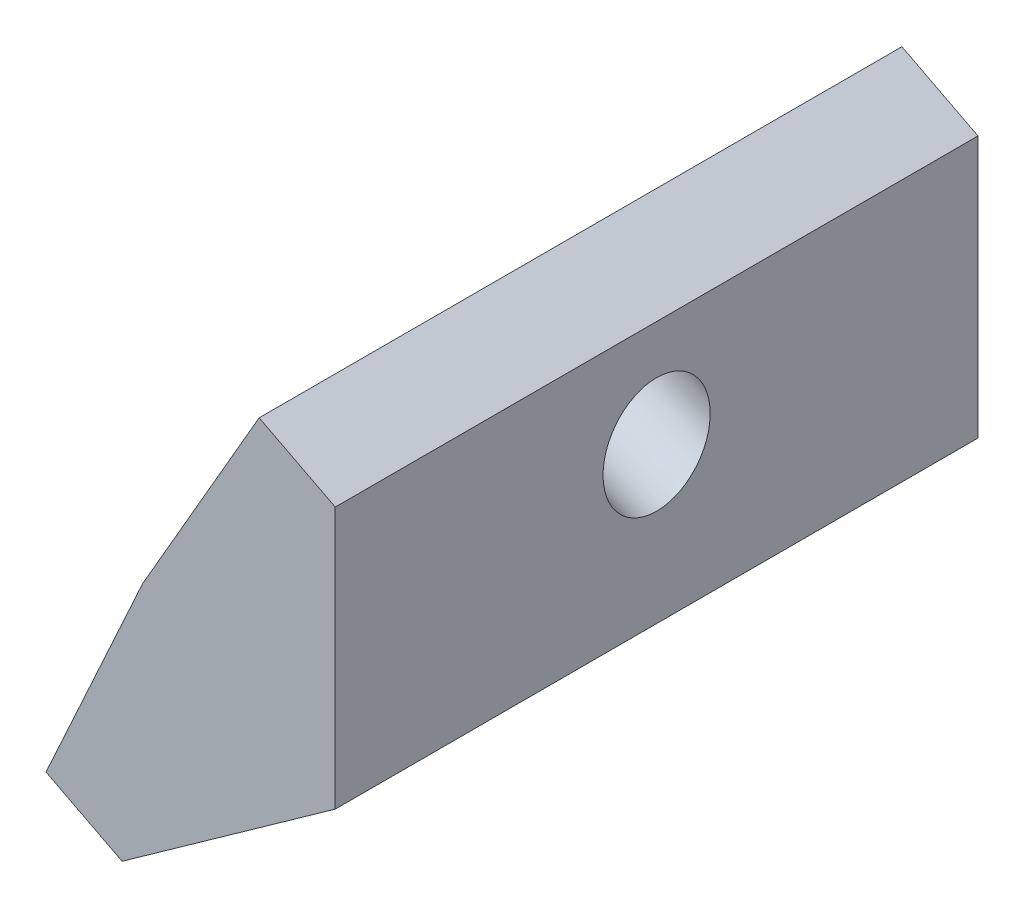
ISO-10303-21;
HEADER;
FILE_DESCRIPTION(('STEP AP214'),'2;1');
FILE_NAME('part.step','',(''),(''),'','','');
FILE_SCHEMA(('AUTOMOTIVE_DESIGN { 1 0 10303 214 1 1 1 1 }'));
ENDSEC;
DATA;
#1=APPLICATION_CONTEXT('core data for automotive mechanical design processes');
#2=APPLICATION_PROTOCOL_DEFINITION('international standard','automotive_design',2000,#1);
#3=PRODUCT_CONTEXT('',#1,'mechanical');
#4=PRODUCT('Part','Part','',(#3));
#5=PRODUCT_RELATED_PRODUCT_CATEGORY('part','',(#4));
#6=PRODUCT_DEFINITION_FORMATION('','',#4);
#7=PRODUCT_DEFINITION_CONTEXT('part definition',#1,'design');
#8=PRODUCT_DEFINITION('design','',#6,#7);
#9=PRODUCT_DEFINITION_SHAPE('','',#8);
#10=(LENGTH_UNIT() NAMED_UNIT(*) SI_UNIT(.MILLI.,.METRE.));
#11=(NAMED_UNIT(*) PLANE_ANGLE_UNIT() SI_UNIT($,.RADIAN.));
#12=(NAMED_UNIT(*) SI_UNIT($,.STERADIAN.) SOLID_ANGLE_UNIT());
#13=UNCERTAINTY_MEASURE_WITH_UNIT(LENGTH_MEASURE(1.E-05),#10,'distance_accuracy_value','');
#14=(GEOMETRIC_REPRESENTATION_CONTEXT(3) GLOBAL_UNCERTAINTY_ASSIGNED_CONTEXT((#13)) GLOBAL_UNIT_ASSIGNED_CONTEXT((#10,
#11,#12)) REPRESENTATION_CONTEXT('',''));
#15=CARTESIAN_POINT('',(0.,0.,0.));
#16=DIRECTION('',(0.,0.,1.));
#17=DIRECTION('',(1.,0.,0.));
#18=AXIS2_PLACEMENT_3D('',#15,#16,#17);
#19=CARTESIAN_POINT('',(-5.30593452675804,-3.07548921601845,7.5));
#20=DIRECTION('',(0.866025403784439,-0.499999999999999,0.));
#21=DIRECTION('',(0.5,0.866025403784439,0.));
#22=AXIS2_PLACEMENT_3D('',#19,#20,#21);
#23=PLANE('',#22);
#24=DIRECTION('',(-0.499999999999999,-0.866025403784439,0.));
#25=VECTOR('',#24,1.);
#26=CARTESIAN_POINT('',(-5.30593452675804,-3.07548921601845,-7.5));
#27=LINE('',#26,#25);
#28=CARTESIAN_POINT('',(-5.30593452675804,-3.07548921601845,-7.5));
#29=VERTEX_POINT('',#28);
#30=CARTESIAN_POINT('',(-8.02245661280733,-7.78064348893881,-7.5));
#31=VERTEX_POINT('',#30);
#32=EDGE_CURVE('E153',#29,#31,#27,.T.);
#33=ORIENTED_EDGE('',*,*,#32,.T.);
#34=DIRECTION('',(0.,0.,-1.));
#35=VECTOR('',#34,1.);
#36=CARTESIAN_POINT('',(-8.02245661280733,-7.78064348893881,7.5));
#37=LINE('',#36,#35);
#38=CARTESIAN_POINT('',(-8.02245661280733,-7.78064348893881,7.5));
#39=VERTEX_POINT('',#38);
#40=EDGE_CURVE('E123',#39,#31,#37,.T.);
#41=ORIENTED_EDGE('',*,*,#40,.F.);
#42=DIRECTION('',(-0.499999999999999,-0.866025403784439,0.));
#43=VECTOR('',#42,1.);
#44=CARTESIAN_POINT('',(-5.30593452675804,-3.07548921601845,7.5));
#45=LINE('',#44,#43);
#46=CARTESIAN_POINT('',(-5.30593452675804,-3.07548921601845,7.5));
#47=VERTEX_POINT('',#46);
#48=EDGE_CURVE('E86',#47,#39,#45,.T.);
#49=ORIENTED_EDGE('',*,*,#48,.F.);
#50=DIRECTION('',(0.,0.,-1.));
#51=VECTOR('',#50,1.);
#52=CARTESIAN_POINT('',(-5.30593452675804,-3.07548921601845,7.5));
#53=LINE('',#52,#51);
#54=EDGE_CURVE('E11',#47,#29,#53,.T.);
#55=ORIENTED_EDGE('',*,*,#54,.T.);
#56=EDGE_LOOP('',(#33,#41,#49,#55));
#57=FACE_BOUND('',#56,.T.);
#58=CARTESIAN_POINT('',(-7.15466967636295,-6.2775924248726,0.));
#59=CARTESIAN_POINT('',(-7.15466798521054,-6.27758949571069,0.0692362236254914));
#60=CARTESIAN_POINT('',(-7.15178289084238,-6.27259236568042,0.138545126920933));
#61=CARTESIAN_POINT('',(-7.14031807431845,-6.25273472096152,0.275213202125542));
#62=CARTESIAN_POINT('',(-7.1317383521396,-6.23787420623293,0.342572374026811));
#63=CARTESIAN_POINT('',(-7.10912290777668,-6.19870310756059,0.473532214921225));
#64=CARTESIAN_POINT('',(-7.09508719143439,-6.17439253373511,0.537132887938548));
#65=CARTESIAN_POINT('',(-7.0619463726398,-6.11699095177845,0.658808329160825));
#66=CARTESIAN_POINT('',(-7.04284127919197,-6.08389995924346,0.716883107180881));
#67=CARTESIAN_POINT('',(-7.0000888158206,-6.00985052053553,0.825908509980911));
#68=CARTESIAN_POINT('',(-6.97644145522332,-5.96889209051615,0.876859149387921));
#69=CARTESIAN_POINT('',(-6.92525666538034,-5.88023743393338,0.970230067617252));
#70=CARTESIAN_POINT('',(-6.89771924432411,-5.83254122155456,1.01265036439745));
#71=CARTESIAN_POINT('',(-6.83951387457678,-5.73172656387885,1.08779088424615));
#72=CARTESIAN_POINT('',(-6.80884593191688,-5.67860812902831,1.12051112600214));
#73=CARTESIAN_POINT('',(-6.74522537987903,-5.56841410049315,1.17534904865513));
#74=CARTESIAN_POINT('',(-6.71227277401225,-5.51133851289008,1.19746674584623));
#75=CARTESIAN_POINT('',(-6.64499176274149,-5.39480438298452,1.23048960581179));
#76=CARTESIAN_POINT('',(-6.61066335868405,-5.33534584301429,1.24139477955999));
#77=CARTESIAN_POINT('',(-6.54157755498611,-5.21568572092774,1.25169183715553));
#78=CARTESIAN_POINT('',(-6.50682015548005,-5.15548413904427,1.2510837246107));
#79=CARTESIAN_POINT('',(-6.4378350069323,-5.03599835679186,1.23837099278326));
#80=CARTESIAN_POINT('',(-6.4036072578896,-4.9767141564212,1.22626637352244));
#81=CARTESIAN_POINT('',(-6.33662545695099,-4.86069827401307,1.19089449813803));
#82=CARTESIAN_POINT('',(-6.30387140504538,-4.8039665919588,1.16762724208794));
#83=CARTESIAN_POINT('',(-6.24074039464589,-4.69462047441372,1.11057184917355));
#84=CARTESIAN_POINT('',(-6.21036343612693,-4.64200603887946,1.07678371242026));
#85=CARTESIAN_POINT('',(-6.15282444014098,-4.54234557441529,0.999618494192085));
#86=CARTESIAN_POINT('',(-6.12566240263102,-4.49529954541096,0.956241412845338));
#87=CARTESIAN_POINT('',(-6.07530239939776,-4.40807346114163,0.861094711792195));
#88=CARTESIAN_POINT('',(-6.05210443361614,-4.36789340577562,0.80932509220926));
#89=CARTESIAN_POINT('',(-6.01031238668225,-4.29550745713381,0.698821187597263));
#90=CARTESIAN_POINT('',(-5.99171830546347,-4.26330156374282,0.640086902668814));
#91=CARTESIAN_POINT('',(-5.95964685844257,-4.20775218803036,0.517273621051155));
#92=CARTESIAN_POINT('',(-5.94616949257598,-4.18440870559724,0.453194624429283));
#93=CARTESIAN_POINT('',(-5.92470318368016,-4.14722796793871,0.321459273157209));
#94=CARTESIAN_POINT('',(-5.91671424059949,-4.13339071262422,0.25380291854053));
#95=CARTESIAN_POINT('',(-5.9064451121526,-4.11560406040475,0.116778861933689));
#96=CARTESIAN_POINT('',(-5.90416492675717,-4.11165466344919,0.0474111599522843));
#97=CARTESIAN_POINT('',(-5.90537620095076,-4.11375265189438,-0.0911223855033391));
#98=CARTESIAN_POINT('',(-5.90886766053804,-4.11980003729212,-0.160288228977619));
#99=CARTESIAN_POINT('',(-5.92152593048045,-4.14172480396831,-0.296510418372036));
#100=CARTESIAN_POINT('',(-5.93069274086139,-4.15760218529144,-0.363566764282583));
#101=CARTESIAN_POINT('',(-5.95444889166487,-4.19874904547534,-0.493720495009659));
#102=CARTESIAN_POINT('',(-5.96903823213565,-4.22401852441965,-0.556817879790968));
#103=CARTESIAN_POINT('',(-6.00323706671206,-4.28325264346565,-0.677313405957969));
#104=CARTESIAN_POINT('',(-6.0228465608793,-4.31721728367402,-0.734711547273723));
#105=CARTESIAN_POINT('',(-6.0665448657214,-4.39290496786517,-0.84222548250053));
#106=CARTESIAN_POINT('',(-6.09063367646033,-4.4346280119589,-0.892341276307429));
#107=CARTESIAN_POINT('',(-6.14262623040584,-4.5246817570078,-0.983908255781001));
#108=CARTESIAN_POINT('',(-6.17052997366876,-4.57301245806052,-1.02535944131973));
#109=CARTESIAN_POINT('',(-6.22938278376548,-4.67494851531625,-1.09845391503492));
#110=CARTESIAN_POINT('',(-6.26033185064073,-4.72855387159104,-1.13009720307788));
#111=CARTESIAN_POINT('',(-6.32442169973164,-4.83956074646591,-1.18270310300237));
#112=CARTESIAN_POINT('',(-6.35756248197132,-4.89696226510762,-1.20366571476677));
#113=CARTESIAN_POINT('',(-6.42512169807883,-5.01397825992534,-1.2343320719433));
#114=CARTESIAN_POINT('',(-6.45954013195575,-5.07359273611712,-1.24403581727527));
#115=CARTESIAN_POINT('',(-6.52870534475454,-5.19339039880095,-1.2519167922377));
#116=CARTESIAN_POINT('',(-6.56345212367724,-5.25357358529443,-1.25009402183942));
#117=CARTESIAN_POINT('',(-6.63231566298722,-5.37284873416833,-1.23497224056463));
#118=CARTESIAN_POINT('',(-6.66643242337602,-5.43194069655138,-1.22167322971574));
#119=CARTESIAN_POINT('',(-6.733094939949,-5.54740356221617,-1.183965783398));
#120=CARTESIAN_POINT('',(-6.76564069614424,-5.60377446551709,-1.15955734800739));
#121=CARTESIAN_POINT('',(-6.82826355553612,-5.71224043969908,-1.10030427672833));
#122=CARTESIAN_POINT('',(-6.85834065875969,-5.76433551062679,-1.06545964095371));
#123=CARTESIAN_POINT('',(-6.91519664850416,-5.86281297357882,-0.986295271867666));
#124=CARTESIAN_POINT('',(-6.94197553506984,-5.9091953656807,-0.941975538684886));
#125=CARTESIAN_POINT('',(-6.99149653531914,-5.99496825415412,-0.84508327715462));
#126=CARTESIAN_POINT('',(-7.01423864906235,-6.03435875062887,-0.792510748928942));
#127=CARTESIAN_POINT('',(-7.0550587659998,-6.10506126713544,-0.680563297275454));
#128=CARTESIAN_POINT('',(-7.07313676926085,-6.13637328728298,-0.621188373945084));
#129=CARTESIAN_POINT('',(-7.10413043441191,-6.1900558900374,-0.497272324052833));
#130=CARTESIAN_POINT('',(-7.11704609636552,-6.21242647275442,-0.432731197554596));
#131=CARTESIAN_POINT('',(-7.13619088484642,-6.24558621910349,-0.307876369961909));
#132=CARTESIAN_POINT('',(-7.14301768018292,-6.2574105754792,-0.247928721161059));
#133=CARTESIAN_POINT('',(-7.149953216237,-6.26942327630258,-0.156436487901762));
#134=CARTESIAN_POINT('',(-7.15171468594311,-6.27247423132956,-0.125363392188712));
#135=CARTESIAN_POINT('',(-7.15407662536004,-6.27656523040408,-0.0628658555110105));
#136=CARTESIAN_POINT('',(-7.15467044432142,-6.27759375501569,-0.0314404213972012));
#137=CARTESIAN_POINT('',(-7.15466967636295,-6.2775924248726,0.));
#138=B_SPLINE_CURVE_WITH_KNOTS('',3,(#58,#59,#60,#61,#62,#63,#64,#65,#66,#67,#68,#69,#70,#71,
#72,#73,#74,#75,#76,#77,#78,#79,#80,#81,#82,#83,#84,#85,#86,#87,#88,#89,#90,#91,#92,#93,#94,#95,
#96,#97,#98,#99,#100,#101,#102,#103,#104,#105,#106,#107,#108,#109,#110,#111,#112,#113,#114,#115,
#116,#117,#118,#119,#120,#121,#122,#123,#124,#125,#126,#127,#128,#129,#130,#131,#132,#133,#134,
#135,#136,#137),.UNSPECIFIED.,.T.,.F.,(4,2,2,2,2,2,2,2,2,2,2,2,2,2,2,2,2,2,2,2,2,2,2,2,2,2,2,2,
2,2,2,2,2,2,2,2,2,2,2,4),(0.,0.207596123907973,0.415192248656901,0.622788151131218,
0.830383684866538,1.03797879236759,1.24557346283966,1.45316773337083,1.66076168486803,
1.86835543319228,2.07594911646454,2.28354279934329,2.49113648085512,2.6987301601764,
2.9063238367235,3.11391751021676,3.32151118071111,3.52910484859004,3.73669851452359,
3.94429217939492,4.15188584420358,4.35947950995598,4.56707317755514,4.77466684770174,
4.98226052081737,5.18985419699834,5.3974478760051,5.60504155728848,5.81263524004989,
6.02022892332876,6.22782260610787,6.4354162874247,6.64300996647699,6.85060364271061,
7.05819731588021,7.26579098607621,7.47338465371476,7.65713146999041,7.75086924008962,
7.84513939629271),.UNSPECIFIED.);
#139=CARTESIAN_POINT('',(-7.15466967636295,-6.2775924248726,0.));
#140=VERTEX_POINT('',#139);
#141=EDGE_CURVE('E162',#140,#140,#138,.T.);
#142=ORIENTED_EDGE('',*,*,#141,.F.);
#143=EDGE_LOOP('',(#142));
#144=FACE_BOUND('',#143,.T.);
#145=ADVANCED_FACE('F38',(#57,#144),#23,.F.);
#146=CARTESIAN_POINT('',(-3.5303,-10.0970811615136,7.5));
#147=DIRECTION('',(-1.,0.,0.));
#148=DIRECTION('',(0.,-1.,0.));
#149=AXIS2_PLACEMENT_3D('',#146,#147,#148);
#150=PLANE('',#149);
#151=DIRECTION('',(0.,1.,0.));
#152=VECTOR('',#151,1.);
#153=CARTESIAN_POINT('',(-3.5303,-10.0970811615136,-7.5));
#154=LINE('',#153,#152);
#155=CARTESIAN_POINT('',(-3.5303,-10.0970811615136,-7.5));
#156=VERTEX_POINT('',#155);
#157=CARTESIAN_POINT('',(-3.5303,-3.99106819498268,-7.5));
#158=VERTEX_POINT('',#157);
#159=EDGE_CURVE('E79',#156,#158,#154,.T.);
#160=ORIENTED_EDGE('',*,*,#159,.T.);
#161=DIRECTION('',(0.,0.,-1.));
#162=VECTOR('',#161,1.);
#163=CARTESIAN_POINT('',(-3.5303,-3.99106819498268,7.5));
#164=LINE('',#163,#162);
#165=CARTESIAN_POINT('',(-3.5303,-3.99106819498268,7.5));
#166=VERTEX_POINT('',#165);
#167=EDGE_CURVE('E53',#166,#158,#164,.T.);
#168=ORIENTED_EDGE('',*,*,#167,.F.);
#169=DIRECTION('',(0.,1.,0.));
#170=VECTOR('',#169,1.);
#171=CARTESIAN_POINT('',(-3.5303,-10.0970811615136,7.5));
#172=LINE('',#171,#170);
#173=CARTESIAN_POINT('',(-3.5303,-10.0970811615136,7.5));
#174=VERTEX_POINT('',#173);
#175=EDGE_CURVE('E62',#174,#166,#172,.T.);
#176=ORIENTED_EDGE('',*,*,#175,.F.);
#177=DIRECTION('',(0.,0.,-1.));
#178=VECTOR('',#177,1.);
#179=CARTESIAN_POINT('',(-3.5303,-10.0970811615136,7.5));
#180=LINE('',#179,#178);
#181=EDGE_CURVE('E76',#174,#156,#180,.T.);
#182=ORIENTED_EDGE('',*,*,#181,.T.);
#183=EDGE_LOOP('',(#160,#168,#176,#182));
#184=FACE_BOUND('',#183,.T.);
#185=CARTESIAN_POINT('',(-3.5303,-7.8245713723151,0.));
#186=CARTESIAN_POINT('',(-3.5303,-7.82457391247035,-0.0326195037891876));
#187=CARTESIAN_POINT('',(-3.53030000000001,-7.82319592864882,-0.0652242599714394));
#188=CARTESIAN_POINT('',(-3.53029999999998,-7.81498950017009,-0.162056922274657));
#189=CARTESIAN_POINT('',(-3.53029999999989,-7.80414604690198,-0.225997391363022));
#190=CARTESIAN_POINT('',(-3.5303000000001,-7.77187662782992,-0.352023967831403));
#191=CARTESIAN_POINT('',(-3.53030000000041,-7.75030853994581,-0.414072957647794));
#192=CARTESIAN_POINT('',(-3.53029999999959,-7.69732694150654,-0.533842655522574));
#193=CARTESIAN_POINT('',(-3.53029999999847,-7.66591296041661,-0.591563156559272));
#194=CARTESIAN_POINT('',(-3.53029999999913,-7.61199323708082,-0.67425367257423));
#195=CARTESIAN_POINT('',(-3.53029999999976,-7.59269944456054,-0.701375129832954));
#196=CARTESIAN_POINT('',(-3.53030000000024,-7.5520294322514,-0.753997309228562));
#197=CARTESIAN_POINT('',(-3.53030000000008,-7.53065382125852,-0.779498501604049));
#198=CARTESIAN_POINT('',(-3.53029999999983,-7.46313625607387,-0.853934708165165));
#199=CARTESIAN_POINT('',(-3.53029999999996,-7.41399868632011,-0.900200022014076));
#200=CARTESIAN_POINT('',(-3.53030000000004,-7.30925376205158,-0.984748717940325));
#201=CARTESIAN_POINT('',(-3.53029999999999,-7.25364182854817,-1.02302639668288));
#202=CARTESIAN_POINT('',(-3.53029999999998,-7.16388964946747,-1.07551943791076));
#203=CARTESIAN_POINT('',(-3.5303,-7.13148260544302,-1.09276250143054));
#204=CARTESIAN_POINT('',(-3.5303,-7.06544087744419,-1.12462071974914));
#205=CARTESIAN_POINT('',(-3.5303,-7.03180736542513,-1.13923830806639));
#206=CARTESIAN_POINT('',(-3.53029999999999,-6.92934375942115,-1.17909131531915));
#207=CARTESIAN_POINT('',(-3.53029999999999,-6.85891964257103,-1.20034494974378));
#208=CARTESIAN_POINT('',(-3.5303,-6.71570787908166,-1.23188598101619));
#209=CARTESIAN_POINT('',(-3.5303,-6.64292047793601,-1.24217451316674));
#210=CARTESIAN_POINT('',(-3.5303,-6.4966230994719,-1.25168740035256));
#211=CARTESIAN_POINT('',(-3.5303,-6.42311315025791,-1.25091218403848));
#212=CARTESIAN_POINT('',(-3.5303,-6.27704464661253,-1.23830229201089));
#213=CARTESIAN_POINT('',(-3.5303,-6.20448611717345,-1.22646732636306));
#214=CARTESIAN_POINT('',(-3.5303,-6.06200248843991,-1.19187674889382));
#215=CARTESIAN_POINT('',(-3.5303,-5.99207762963375,-1.16912014237963));
#216=CARTESIAN_POINT('',(-3.5303,-5.85660182030777,-1.11298072576296));
#217=CARTESIAN_POINT('',(-3.53030000000001,-5.79105154962075,-1.07959626866955));
#218=CARTESIAN_POINT('',(-3.53030000000003,-5.66613352871973,-1.00270845761217));
#219=CARTESIAN_POINT('',(-3.53030000000005,-5.60676711118886,-0.959202928959605));
#220=CARTESIAN_POINT('',(-3.53030000000007,-5.49756995916535,-0.864166618632253));
#221=CARTESIAN_POINT('',(-3.53030000000008,-5.44752790415538,-0.812879567568417));
#222=CARTESIAN_POINT('',(-3.53030000000007,-5.35842416308745,-0.704581337454006));
#223=CARTESIAN_POINT('',(-3.53030000000006,-5.31903261414969,-0.64784196062456));
#224=CARTESIAN_POINT('',(-3.53030000000006,-5.25139804578411,-0.530329191875033));
#225=CARTESIAN_POINT('',(-3.53030000000007,-5.22284955349265,-0.469733412710931));
#226=CARTESIAN_POINT('',(-3.53030000000003,-5.18823300293157,-0.376681968776199));
#227=CARTESIAN_POINT('',(-3.5303,-5.17813364590145,-0.345677565407062));
#228=CARTESIAN_POINT('',(-3.5303,-5.16053113536385,-0.282907376563175));
#229=CARTESIAN_POINT('',(-3.53030000000001,-5.15303050134665,-0.251140883953147));
#230=CARTESIAN_POINT('',(-3.53030000000003,-5.13455958657639,-0.155002645801818));
#231=CARTESIAN_POINT('',(-3.5303,-5.12762649369155,-0.0898087732382496));
#232=CARTESIAN_POINT('',(-3.5303,-5.12486330072194,0.0408010040458095));
#233=CARTESIAN_POINT('',(-3.53030000000001,-5.12903070994771,0.106216855670132));
#234=CARTESIAN_POINT('',(-3.5303,-5.14336972856942,0.202578607103788));
#235=CARTESIAN_POINT('',(-3.5303,-5.14942550739006,0.234184220831884));
#236=CARTESIAN_POINT('',(-3.5303,-5.16411304901567,0.296786671768801));
#237=CARTESIAN_POINT('',(-3.53030000000002,-5.17274445147549,0.327783593491137));
#238=CARTESIAN_POINT('',(-3.53029999999997,-5.20265032586628,0.420344270080214));
#239=CARTESIAN_POINT('',(-3.53029999999981,-5.2278184766318,0.480691827646078));
#240=CARTESIAN_POINT('',(-3.53030000000019,-5.28753573569402,0.59655847385015));
#241=CARTESIAN_POINT('',(-3.53030000000072,-5.32208897090053,0.652075424108309));
#242=CARTESIAN_POINT('',(-3.53030000000041,-5.380641969035,0.731580509745655));
#243=CARTESIAN_POINT('',(-3.53030000000011,-5.40165206951158,0.757820268613113));
#244=CARTESIAN_POINT('',(-3.53029999999989,-5.44567263119267,0.808548724835156));
#245=CARTESIAN_POINT('',(-3.53029999999996,-5.46868242836855,0.833037998578282));
#246=CARTESIAN_POINT('',(-3.53030000000008,-5.54100157626801,0.904234735132836));
#247=CARTESIAN_POINT('',(-3.53030000000002,-5.59316958150936,0.948089166732138));
#248=CARTESIAN_POINT('',(-3.53029999999998,-5.70355970450466,1.02740940934581));
#249=CARTESIAN_POINT('',(-3.53030000000001,-5.76178610110278,1.06286923283272));
#250=CARTESIAN_POINT('',(-3.53030000000001,-5.85531963166608,1.11079434891979));
#251=CARTESIAN_POINT('',(-3.5303,-5.88905503004722,1.12639778016577));
#252=CARTESIAN_POINT('',(-3.5303,-5.95762116709879,1.15487206036833));
#253=CARTESIAN_POINT('',(-3.5303,-5.99245086158251,1.16774542859163));
#254=CARTESIAN_POINT('',(-3.5303,-6.09829979633528,1.2022180310745));
#255=CARTESIAN_POINT('',(-3.53029999999999,-6.17071047833687,1.21968583257396));
#256=CARTESIAN_POINT('',(-3.53029999999999,-6.3173058882018,1.24331748594907));
#257=CARTESIAN_POINT('',(-3.5303,-6.391490469082,1.24948227111372));
#258=CARTESIAN_POINT('',(-3.5303,-6.53994152685629,1.250454945382));
#259=CARTESIAN_POINT('',(-3.5303,-6.61420800256364,1.24526299694992));
#260=CARTESIAN_POINT('',(-3.53029999999999,-6.76108084193489,1.22357810221477));
#261=CARTESIAN_POINT('',(-3.5303,-6.83368711572571,1.20708454560202));
#262=CARTESIAN_POINT('',(-3.5303,-6.97547342185756,1.16300134919204));
#263=CARTESIAN_POINT('',(-3.5303,-7.04465303498637,1.13541035549923));
#264=CARTESIAN_POINT('',(-3.53029999999998,-7.17774998269338,1.06952078753474));
#265=CARTESIAN_POINT('',(-3.53029999999996,-7.24166632475417,1.03122019966774));
#266=CARTESIAN_POINT('',(-3.53029999999994,-7.36124346572941,0.945337730839185));
#267=CARTESIAN_POINT('',(-3.53029999999993,-7.41703027019361,0.897931962544143));
#268=CARTESIAN_POINT('',(-3.53029999999992,-7.51790864074305,0.796312147729842));
#269=CARTESIAN_POINT('',(-3.53029999999992,-7.56332166520749,0.742418229440086));
#270=CARTESIAN_POINT('',(-3.53029999999993,-7.64305537899445,0.629686247433407));
#271=CARTESIAN_POINT('',(-3.53029999999994,-7.67770016729275,0.571078002521966));
#272=CARTESIAN_POINT('',(-3.53029999999996,-7.73583985249603,0.450533001650125));
#273=CARTESIAN_POINT('',(-3.53029999999996,-7.75961605172873,0.388732726990086));
#274=CARTESIAN_POINT('',(-3.53029999999998,-7.79342096031445,0.272596868053064));
#275=CARTESIAN_POINT('',(-3.5303,-7.80507834481693,0.218729068130521));
#276=CARTESIAN_POINT('',(-3.5303,-7.82064865387852,0.109893032888469));
#277=CARTESIAN_POINT('',(-3.5303,-7.82456709513247,0.0549256096892129));
#278=CARTESIAN_POINT('',(-3.5303,-7.8245713723151,0.));
#279=B_SPLINE_CURVE_WITH_KNOTS('',3,(#185,#186,#187,#188,#189,#190,#191,#192,#193,#194,#195,
#196,#197,#198,#199,#200,#201,#202,#203,#204,#205,#206,#207,#208,#209,#210,#211,#212,#213,#214,
#215,#216,#217,#218,#219,#220,#221,#222,#223,#224,#225,#226,#227,#228,#229,#230,#231,#232,#233,
#234,#235,#236,#237,#238,#239,#240,#241,#242,#243,#244,#245,#246,#247,#248,#249,#250,#251,#252,
#253,#254,#255,#256,#257,#258,#259,#260,#261,#262,#263,#264,#265,#266,#267,#268,#269,#270,#271,
#272,#273,#274,#275,#276,#277,#278),.UNSPECIFIED.,.T.,.F.,(4,2,2,2,2,2,2,2,2,2,2,2,2,2,2,2,2,2,
2,2,2,2,2,2,2,2,2,2,2,2,2,2,2,2,2,2,2,2,2,2,2,2,2,2,2,2,4),(0.,0.0978176838573576,
0.291389059184773,0.487596872273418,0.683814063554577,0.783576191088796,0.883309231815926,
1.08491198051467,1.28665818884161,1.39668083354719,1.50660096744318,1.72633503776649,
1.9460463550926,2.16574916001042,2.38545772465813,2.60518630314881,2.82494894942054,
3.04475885921046,3.25873296503977,3.46502069773662,3.66496738153368,3.76269381574919,
3.86051473340601,4.05620914893308,4.25185965897259,4.34830631979627,4.44473949347695,
4.63996125574701,4.83526900239106,4.9360201621942,5.03673799300387,5.24032198853683,
5.44405075755846,5.55545229713349,5.66675058514081,5.88924200915281,6.11171506124111,
6.3341849307511,6.55666681503035,6.77917585050209,7.00172674981673,7.22034195917831,
7.43079808199233,7.63411296728674,7.83181732269259,7.99664294346761,8.16135102606072),.UNSPECIFIED.);
#280=CARTESIAN_POINT('',(-3.5303,-7.8245713723151,0.));
#281=VERTEX_POINT('',#280);
#282=EDGE_CURVE('E42',#281,#281,#279,.T.);
#283=ORIENTED_EDGE('',*,*,#282,.F.);
#284=EDGE_LOOP('',(#283));
#285=FACE_BOUND('',#284,.T.);
#286=ADVANCED_FACE('F182',(#184,#285),#150,.F.);
#287=CARTESIAN_POINT('',(-10.2804154322381,-12.7222617406585,7.5));
#288=DIRECTION('',(0.909548697781145,-0.415597360873024,0.));
#289=DIRECTION('',(-0.415597360873024,-0.909548697781146,0.));
#290=AXIS2_PLACEMENT_3D('',#287,#288,#289);
#291=PLANE('',#290);
#292=DIRECTION('',(0.415597360873024,0.909548697781145,0.));
#293=VECTOR('',#292,1.);
#294=CARTESIAN_POINT('',(-10.2804154322381,-12.7222617406585,-7.5));
#295=LINE('',#294,#293);
#296=CARTESIAN_POINT('',(-10.2804154322381,-12.7222617406585,-7.5));
#297=VERTEX_POINT('',#296);
#298=EDGE_CURVE('E118',#297,#31,#295,.T.);
#299=ORIENTED_EDGE('',*,*,#298,.F.);
#300=DIRECTION('',(0.,0.,-1.));
#301=VECTOR('',#300,1.);
#302=CARTESIAN_POINT('',(-10.2804154322381,-12.7222617406585,7.5));
#303=LINE('',#302,#301);
#304=CARTESIAN_POINT('',(-10.2804154322381,-12.7222617406585,7.5));
#305=VERTEX_POINT('',#304);
#306=EDGE_CURVE('E114',#305,#297,#303,.T.);
#307=ORIENTED_EDGE('',*,*,#306,.F.);
#308=DIRECTION('',(0.415597360873024,0.909548697781145,0.));
#309=VECTOR('',#308,1.);
#310=CARTESIAN_POINT('',(-10.2804154322381,-12.7222617406585,7.5));
#311=LINE('',#310,#309);
#312=EDGE_CURVE('E103',#305,#39,#311,.T.);
#313=ORIENTED_EDGE('',*,*,#312,.T.);
#314=ORIENTED_EDGE('',*,*,#40,.T.);
#315=EDGE_LOOP('',(#299,#307,#313,#314));
#316=FACE_BOUND('',#315,.T.);
#317=CARTESIAN_POINT('',(-9.78286162521347,-11.6333486245968,0.));
#318=CARTESIAN_POINT('',(-9.78286021949484,-11.6333455481347,0.0692358626819145));
#319=CARTESIAN_POINT('',(-9.78046215248974,-11.6280972984415,0.138544405837957));
#320=CARTESIAN_POINT('',(-9.77093269372112,-11.6072417598131,0.275211754098851));
#321=CARTESIAN_POINT('',(-9.763801302646,-11.5916344723844,0.342570559487269));
#322=CARTESIAN_POINT('',(-9.74500353968827,-11.5504949406427,0.473529755417847));
#323=CARTESIAN_POINT('',(-9.73333716782914,-11.524962696381,0.537130145979474));
#324=CARTESIAN_POINT('',(-9.70579078032004,-11.4646765077613,0.658805162167846));
#325=CARTESIAN_POINT('',(-9.68991076470091,-11.4299225634706,0.716879787835021));
#326=CARTESIAN_POINT('',(-9.65437520364528,-11.3521518018489,0.825905040356857));
#327=CARTESIAN_POINT('',(-9.63471965824146,-11.3091349845893,0.876855667273156));
#328=CARTESIAN_POINT('',(-9.59217513388849,-11.2160248728175,0.970226708469674));
#329=CARTESIAN_POINT('',(-9.56928615496858,-11.1659315783692,1.012647122827));
#330=CARTESIAN_POINT('',(-9.52090607935893,-11.0600501678693,1.08778800206829));
#331=CARTESIAN_POINT('',(-9.49541498269115,-11.0042620518656,1.12050846703408));
#332=CARTESIAN_POINT('',(-9.44253374289061,-10.8885296932756,1.17534692644399));
#333=CARTESIAN_POINT('',(-9.41514359977097,-10.8285854507179,1.19746492096138));
#334=CARTESIAN_POINT('',(-9.35921971617508,-10.7061941646119,1.23048843042266));
#335=CARTESIAN_POINT('',(-9.33068597570412,-10.6437471210751,1.24139394541843));
#336=CARTESIAN_POINT('',(-9.27326188537722,-10.5180725824583,1.25169171124795));
#337=CARTESIAN_POINT('',(-9.24437153552192,-10.4548450873796,1.25108396210281));
#338=CARTESIAN_POINT('',(-9.18703104959423,-10.3293535197813,1.23837196303159));
#339=CARTESIAN_POINT('',(-9.15858091352234,-10.2670894472628,1.22626771309218));
#340=CARTESIAN_POINT('',(-9.10290553752402,-10.1452420283298,1.19089655368164));
#341=CARTESIAN_POINT('',(-9.07568029760252,-10.085658681926,1.16762964416559));
#342=CARTESIAN_POINT('',(-9.02320561444145,-9.9708160861132,1.11057488097868));
#343=CARTESIAN_POINT('',(-8.99795617121462,-9.91555683673198,1.07678702723998));
#344=CARTESIAN_POINT('',(-8.95012949024339,-9.81088654887165,0.999622268521565));
#345=CARTESIAN_POINT('',(-8.92755225252081,-9.76147551044028,0.95624536346354));
#346=CARTESIAN_POINT('',(-8.88569269193948,-9.66986446474821,0.861098873798075));
#347=CARTESIAN_POINT('',(-8.86641036911034,-9.62766445755232,0.809329289115193));
#348=CARTESIAN_POINT('',(-8.83167247254296,-9.55163941129084,0.698825296714466));
#349=CARTESIAN_POINT('',(-8.81621689883848,-9.51781437229917,0.640090888935141));
#350=CARTESIAN_POINT('',(-8.78955878970552,-9.45947221055816,0.517277211959707));
#351=CARTESIAN_POINT('',(-8.77835625430978,-9.43495508788048,0.453197942722452));
#352=CARTESIAN_POINT('',(-8.76051320737925,-9.39590498403471,0.321461933665323));
#353=CARTESIAN_POINT('',(-8.75387269558672,-9.38137200230257,0.253805194047554));
#354=CARTESIAN_POINT('',(-8.74533685356897,-9.36269102710245,0.116780330417339));
#355=CARTESIAN_POINT('',(-8.74344152154652,-9.35854302970117,0.0474122070530877));
#356=CARTESIAN_POINT('',(-8.74444831050702,-9.36074642094995,-0.0911221816600563));
#357=CARTESIAN_POINT('',(-8.74735043149086,-9.36709780960196,-0.160288447008912));
#358=CARTESIAN_POINT('',(-8.75787208075343,-9.39012479024778,-0.296511420127743));
#359=CARTESIAN_POINT('',(-8.76549160901905,-9.40680038221291,-0.363568127903578));
#360=CARTESIAN_POINT('',(-8.78523791292043,-9.45001582747407,-0.493722474367872));
#361=CARTESIAN_POINT('',(-8.79736468853169,-9.47655568071649,-0.556820113077853));
#362=CARTESIAN_POINT('',(-8.82579101057157,-9.53876763543093,-0.677316012191553));
#363=CARTESIAN_POINT('',(-8.84209055696889,-9.57443973683447,-0.734714272638009));
#364=CARTESIAN_POINT('',(-8.87841285416,-9.65393229675159,-0.842228309051983));
#365=CARTESIAN_POINT('',(-8.89843560492125,-9.69775275519394,-0.892344085083144));
#366=CARTESIAN_POINT('',(-8.94165205564256,-9.79233340025319,-0.983910912570452));
#367=CARTESIAN_POINT('',(-8.96484575557401,-9.84309358680746,-1.02536196410478));
#368=CARTESIAN_POINT('',(-9.01376439367196,-9.95015365929145,-1.0984560898284));
#369=CARTESIAN_POINT('',(-9.0394893318174,-10.0064535451751,-1.13009916409927));
#370=CARTESIAN_POINT('',(-9.09276092410719,-10.1230402032186,-1.18270459852465));
#371=CARTESIAN_POINT('',(-9.12030757823932,-10.1833269753518,-1.20366695875074));
#372=CARTESIAN_POINT('',(-9.17646283820523,-10.3062246363674,-1.2343328115842));
#373=CARTESIAN_POINT('',(-9.20507144403439,-10.3688355252397,-1.24403630424056));
#374=CARTESIAN_POINT('',(-9.26256155520317,-10.4946545526729,-1.2519167950458));
#375=CARTESIAN_POINT('',(-9.29144306054236,-10.5578626912329,-1.25009379321224));
#376=CARTESIAN_POINT('',(-9.3486823923524,-10.683132879668,-1.23497157381143));
#377=CARTESIAN_POINT('',(-9.37704021882248,-10.7451949295414,-1.22167235622729));
#378=CARTESIAN_POINT('',(-9.43245005662419,-10.8664612092669,-1.18396450648421));
#379=CARTESIAN_POINT('',(-9.45950206795022,-10.9256654391067,-1.15955587427746));
#380=CARTESIAN_POINT('',(-9.51155415471512,-11.0395831685994,-1.10030239222836));
#381=CARTESIAN_POINT('',(-9.53655423014033,-11.0942966682224,-1.06545754231645));
#382=CARTESIAN_POINT('',(-9.58381290857688,-11.1977238635745,-0.986292697665745));
#383=CARTESIAN_POINT('',(-9.60607151156549,-11.2464375592538,-0.941972702848335));
#384=CARTESIAN_POINT('',(-9.64723334615726,-11.3365216083262,-0.845079848038765));
#385=CARTESIAN_POINT('',(-9.66613657773016,-11.377891961653,-0.792506987972176));
#386=CARTESIAN_POINT('',(-9.70006620977775,-11.4521480940313,-0.680558797629221));
#387=CARTESIAN_POINT('',(-9.71509261021852,-11.4850338730087,-0.621183467293314));
#388=CARTESIAN_POINT('',(-9.74085443255294,-11.5414144811711,-0.497266542456662));
#389=CARTESIAN_POINT('',(-9.75158985441429,-11.5649093102856,-0.432724947917026));
#390=CARTESIAN_POINT('',(-9.76750262342835,-11.5997349364744,-0.307870659100862));
#391=CARTESIAN_POINT('',(-9.77317684676843,-11.6121531636716,-0.247924083108692));
#392=CARTESIAN_POINT('',(-9.77894145043296,-11.624769191226,-0.156433524947281));
#393=CARTESIAN_POINT('',(-9.78040552931435,-11.627973376732,-0.125361012415933));
#394=CARTESIAN_POINT('',(-9.78236869975118,-11.6322698407677,-0.0628646576544186));
#395=CARTESIAN_POINT('',(-9.78286226354659,-11.6333500216102,-0.0314398223443869));
#396=CARTESIAN_POINT('',(-9.78286162521347,-11.6333486245968,0.));
#397=B_SPLINE_CURVE_WITH_KNOTS('',3,(#317,#318,#319,#320,#321,#322,#323,#324,#325,#326,#327,
#328,#329,#330,#331,#332,#333,#334,#335,#336,#337,#338,#339,#340,#341,#342,#343,#344,#345,#346,
#347,#348,#349,#350,#351,#352,#353,#354,#355,#356,#357,#358,#359,#360,#361,#362,#363,#364,#365,
#366,#367,#368,#369,#370,#371,#372,#373,#374,#375,#376,#377,#378,#379,#380,#381,#382,#383,#384,
#385,#386,#387,#388,#389,#390,#391,#392,#393,#394,#395,#396),.UNSPECIFIED.,.T.,.F.,(4,2,2,2,2,2,
2,2,2,2,2,2,2,2,2,2,2,2,2,2,2,2,2,2,2,2,2,2,2,2,2,2,2,2,2,2,2,2,2,4),(0.,0.207595043011116,
0.415190055829752,0.622785067573067,0.830380077797414,1.03797508622557,1.24557009277712,
1.45316509757725,1.66076010094304,1.86835510334871,2.07595010537368,2.28354510763908,
2.49114011073969,2.69873511517879,2.90633012131302,3.11392512931328,3.32152013914604,
3.52911515057699,3.73671015028008,3.94430507135664,4.1518999924715,4.35949491300967,
4.56708983241936,4.77468475027241,4.98227966631121,5.18987458047696,5.39746949291604,
5.60506440396404,5.81265931410893,6.02025422393764,6.22784913407174,6.43544404509935,
6.64303895751067,6.85063387164432,7.05822878765023,7.26582370547316,7.47341862485882,
7.65716205990831,7.75089805762192,7.84516641825211),.UNSPECIFIED.);
#398=CARTESIAN_POINT('',(-9.78286162521347,-11.6333486245968,0.));
#399=VERTEX_POINT('',#398);
#400=EDGE_CURVE('E132',#399,#399,#397,.T.);
#401=ORIENTED_EDGE('',*,*,#400,.F.);
#402=EDGE_LOOP('',(#401));
#403=FACE_BOUND('',#402,.T.);
#404=ADVANCED_FACE('F115',(#316,#403),#291,.F.);
#405=CARTESIAN_POINT('',(-3.5303,-10.0970811615136,7.5));
#406=DIRECTION('',(-0.579893597821015,0.81469222115238,0.));
#407=DIRECTION('',(0.81469222115238,0.579893597821015,0.));
#408=AXIS2_PLACEMENT_3D('',#405,#406,#407);
#409=PLANE('',#408);
#410=DIRECTION('',(-0.81469222115238,-0.579893597821015,0.));
#411=VECTOR('',#410,1.);
#412=CARTESIAN_POINT('',(-3.5303,-10.0970811615136,-7.5));
#413=LINE('',#412,#411);
#414=CARTESIAN_POINT('',(-8.50482126608833,-13.637918989017,-7.5));
#415=VERTEX_POINT('',#414);
#416=EDGE_CURVE('E128',#156,#415,#413,.T.);
#417=ORIENTED_EDGE('',*,*,#416,.F.);
#418=ORIENTED_EDGE('',*,*,#181,.F.);
#419=DIRECTION('',(-0.81469222115238,-0.579893597821015,0.));
#420=VECTOR('',#419,1.);
#421=CARTESIAN_POINT('',(-3.5303,-10.0970811615136,7.5));
#422=LINE('',#421,#420);
#423=CARTESIAN_POINT('',(-8.50482126608833,-13.637918989017,7.5));
#424=VERTEX_POINT('',#423);
#425=EDGE_CURVE('E111',#174,#424,#422,.T.);
#426=ORIENTED_EDGE('',*,*,#425,.T.);
#427=DIRECTION('',(0.,0.,-1.));
#428=VECTOR('',#427,1.);
#429=CARTESIAN_POINT('',(-8.50482126608833,-13.637918989017,7.5));
#430=LINE('',#429,#428);
#431=EDGE_CURVE('E127',#424,#415,#430,.T.);
#432=ORIENTED_EDGE('',*,*,#431,.T.);
#433=EDGE_LOOP('',(#417,#418,#426,#432));
#434=FACE_BOUND('',#433,.T.);
#435=CARTESIAN_POINT('',(-7.58055404623483,-12.9800304888534,0.));
#436=CARTESIAN_POINT('',(-7.58055619446338,-12.9800320179511,-0.032620172346701));
#437=CARTESIAN_POINT('',(-7.57943350201113,-12.979232891424,-0.0652251255952535));
#438=CARTESIAN_POINT('',(-7.57274764280771,-12.9744739323381,-0.162058820600234));
#439=CARTESIAN_POINT('',(-7.56391349844551,-12.9681858352814,-0.226000376510881));
#440=CARTESIAN_POINT('',(-7.53762375121125,-12.9494729327724,-0.352027880413007));
#441=CARTESIAN_POINT('',(-7.52005250161495,-12.9369658105958,-0.414076753130782));
#442=CARTESIAN_POINT('',(-7.47688839883746,-12.9062418313957,-0.533848330684639));
#443=CARTESIAN_POINT('',(-7.45129489807741,-12.888024513429,-0.591570685805678));
#444=CARTESIAN_POINT('',(-7.40736573214612,-12.8567559663396,-0.674263157672953));
#445=CARTESIAN_POINT('',(-7.39164700693161,-12.8455674611833,-0.701384888022065));
#446=CARTESIAN_POINT('',(-7.35851306423365,-12.8219828966793,-0.754007446458208));
#447=CARTESIAN_POINT('',(-7.34109835096923,-12.8095871962321,-0.779508752595852));
#448=CARTESIAN_POINT('',(-7.2860916767446,-12.7704337375487,-0.853945378437238));
#449=CARTESIAN_POINT('',(-7.24605915996378,-12.7419388046366,-0.900210927446113));
#450=CARTESIAN_POINT('',(-7.16072309636488,-12.6811970476156,-0.984759861155538));
#451=CARTESIAN_POINT('',(-7.11541581547448,-12.6489475656138,-1.02303753695062));
#452=CARTESIAN_POINT('',(-7.04229481832196,-12.5969004280395,-1.07552993396083));
#453=CARTESIAN_POINT('',(-7.01589317995116,-12.5781078820133,-1.09277253229497));
#454=CARTESIAN_POINT('',(-6.96208977434013,-12.5398109035413,-1.12462980768852));
#455=CARTESIAN_POINT('',(-6.93468896187141,-12.5203071506967,-1.13924691829635));
#456=CARTESIAN_POINT('',(-6.85121313033932,-12.4608894969848,-1.17909846234491));
#457=CARTESIAN_POINT('',(-6.79383950128233,-12.4200512524182,-1.20035107997038));
#458=CARTESIAN_POINT('',(-6.67716678925065,-12.3370042354087,-1.23188995050248));
#459=CARTESIAN_POINT('',(-6.61786790622416,-12.2947956052878,-1.2421773384781));
#460=CARTESIAN_POINT('',(-6.4986815984277,-12.2099594241575,-1.25168779227564));
#461=CARTESIAN_POINT('',(-6.43879419654135,-12.1673318894366,-1.25091128661166));
#462=CARTESIAN_POINT('',(-6.31979467115402,-12.0826286590335,-1.23829868740145));
#463=CARTESIAN_POINT('',(-6.26068256802191,-12.0405529778498,-1.22646230387454));
#464=CARTESIAN_POINT('',(-6.14460402711693,-11.9579288886938,-1.19186881586603));
#465=CARTESIAN_POINT('',(-6.08763778527683,-11.9173806201854,-1.16911071674634));
#466=CARTESIAN_POINT('',(-5.97726895106773,-11.8388206699428,-1.1129683308006));
#467=CARTESIAN_POINT('',(-5.92386691253264,-11.8008093824245,-1.07958239716685));
#468=CARTESIAN_POINT('',(-5.82209994692271,-11.7283721965835,-1.00269177008623));
#469=CARTESIAN_POINT('',(-5.7737361054725,-11.6939470710026,-0.959184902295506));
#470=CARTESIAN_POINT('',(-5.68477735354303,-11.6306267036606,-0.864146341955463));
#471=CARTESIAN_POINT('',(-5.64401026016697,-11.6016089030277,-0.812858395625815));
#472=CARTESIAN_POINT('',(-5.57142140110195,-11.549940538519,-0.704558369136124));
#473=CARTESIAN_POINT('',(-5.53933095507447,-11.5270987294046,-0.647818017289657));
#474=CARTESIAN_POINT('',(-5.48423251611252,-11.4878799530687,-0.530303246864699));
#475=CARTESIAN_POINT('',(-5.46097571174955,-11.4713258831933,-0.469706389324136));
#476=CARTESIAN_POINT('',(-5.43277602064688,-11.4512534927783,-0.376653390619736));
#477=CARTESIAN_POINT('',(-5.42454884239345,-11.4453974309756,-0.345648382416082));
#478=CARTESIAN_POINT('',(-5.41020963203154,-11.4351908571667,-0.282877055684648));
#479=CARTESIAN_POINT('',(-5.40409965256256,-11.4308418062185,-0.25111003009386));
#480=CARTESIAN_POINT('',(-5.38905372741334,-11.4201321965761,-0.154970025608952));
#481=CARTESIAN_POINT('',(-5.38340692952729,-11.4161128358196,-0.0897750270545907));
#482=CARTESIAN_POINT('',(-5.38115897107998,-11.4145127509311,0.0408366681585154));
#483=CARTESIAN_POINT('',(-5.38455578162907,-11.4169305826463,0.106253311803799));
#484=CARTESIAN_POINT('',(-5.39624018458751,-11.4252474786397,0.202616026761628));
#485=CARTESIAN_POINT('',(-5.40117462354433,-11.4287597860923,0.23422194159285));
#486=CARTESIAN_POINT('',(-5.41314214995202,-11.4372782078538,0.296824909958501));
#487=CARTESIAN_POINT('',(-5.42017494385541,-11.4422841132172,0.327822048011171));
#488=CARTESIAN_POINT('',(-5.44454163868293,-11.4596281972327,0.420383255441069));
#489=CARTESIAN_POINT('',(-5.46504770732243,-11.4742243080236,0.480730994216418));
#490=CARTESIAN_POINT('',(-5.51370245922746,-11.5088565021223,0.596597634165105));
#491=CARTESIAN_POINT('',(-5.54185450422256,-11.5288949782915,0.652114397078273));
#492=CARTESIAN_POINT('',(-5.58955984550702,-11.5628513869501,0.731618818063303));
#493=CARTESIAN_POINT('',(-5.60667748105122,-11.5750356290526,0.757858248603941));
#494=CARTESIAN_POINT('',(-5.64254241996648,-11.6005641021655,0.80858595165373));
#495=CARTESIAN_POINT('',(-5.66128918245067,-11.6139079481754,0.833074800489644));
#496=CARTESIAN_POINT('',(-5.72020962760912,-11.6558472082311,0.904270120100062));
#497=CARTESIAN_POINT('',(-5.76271221863257,-11.6861003268756,0.948123397779057));
#498=CARTESIAN_POINT('',(-5.85264956112245,-11.7501172497831,1.0274408550705));
#499=CARTESIAN_POINT('',(-5.9000877980878,-11.7838835350059,1.06289904748588));
#500=CARTESIAN_POINT('',(-5.97629077252895,-11.838124407652,1.11082092225525));
#501=CARTESIAN_POINT('',(-6.00377505610236,-11.8576875747857,1.12642297510907));
#502=CARTESIAN_POINT('',(-6.05963590750321,-11.8974490322479,1.15489444246823));
#503=CARTESIAN_POINT('',(-6.08801162470438,-11.9176467171052,1.16776637632277));
#504=CARTESIAN_POINT('',(-6.17424651643689,-11.97902825522,1.20223458593728));
#505=CARTESIAN_POINT('',(-6.23323916634511,-12.0210189102331,1.21969933692758));
#506=CARTESIAN_POINT('',(-6.35266940435937,-12.1060287195974,1.24332464035401));
#507=CARTESIAN_POINT('',(-6.41310687279459,-12.1490477887675,1.24948612574852));
#508=CARTESIAN_POINT('',(-6.53404810862469,-12.2351331183552,1.2504519689443));
#509=CARTESIAN_POINT('',(-6.5945518750603,-12.27819937809,1.24525648895915));
#510=CARTESIAN_POINT('',(-6.71420643681599,-12.3633688599025,1.22356435695787));
#511=CARTESIAN_POINT('',(-6.77335715887178,-12.405472029831,1.20706709446575));
#512=CARTESIAN_POINT('',(-6.88886671227423,-12.4876911167035,1.16297641930432));
#513=CARTESIAN_POINT('',(-6.94522520201232,-12.5278067904922,1.13538165268583));
#514=CARTESIAN_POINT('',(-7.05365443858677,-12.6049861454358,1.06948461795692));
#515=CARTESIAN_POINT('',(-7.10572437675081,-12.642049250982,1.03118033635993));
#516=CARTESIAN_POINT('',(-7.20313705325375,-12.7113870769536,0.945291653339315));
#517=CARTESIAN_POINT('',(-7.24858256340126,-12.7437349498067,0.897883539486949));
#518=CARTESIAN_POINT('',(-7.33076051008865,-12.8022287759766,0.796259386920704));
#519=CARTESIAN_POINT('',(-7.36775478640018,-12.8285611054528,0.742363378321768));
#520=CARTESIAN_POINT('',(-7.43270668555335,-12.8747935224409,0.62962782947952));
#521=CARTESIAN_POINT('',(-7.46092829119942,-12.8948815115115,0.571018016244758));
#522=CARTESIAN_POINT('',(-7.50828794611466,-12.9285918624481,0.450469074132241));
#523=CARTESIAN_POINT('',(-7.52765510533591,-12.9423773035616,0.388666395408678));
#524=CARTESIAN_POINT('',(-7.55505704744654,-12.9618818604793,0.273089652672434));
#525=CARTESIAN_POINT('',(-7.56448249366778,-12.96859084306,0.219805132463695));
#526=CARTESIAN_POINT('',(-7.57729232062953,-12.9777088098841,0.111014489783288));
#527=CARTESIAN_POINT('',(-7.58055039220901,-12.9800278879373,0.0554852287514976));
#528=CARTESIAN_POINT('',(-7.58055404623483,-12.9800304888534,0.));
#529=B_SPLINE_CURVE_WITH_KNOTS('',3,(#435,#436,#437,#438,#439,#440,#441,#442,#443,#444,#445,
#446,#447,#448,#449,#450,#451,#452,#453,#454,#455,#456,#457,#458,#459,#460,#461,#462,#463,#464,
#465,#466,#467,#468,#469,#470,#471,#472,#473,#474,#475,#476,#477,#478,#479,#480,#481,#482,#483,
#484,#485,#486,#487,#488,#489,#490,#491,#492,#493,#494,#495,#496,#497,#498,#499,#500,#501,#502,
#503,#504,#505,#506,#507,#508,#509,#510,#511,#512,#513,#514,#515,#516,#517,#518,#519,#520,#521,
#522,#523,#524,#525,#526,#527,#528),.UNSPECIFIED.,.T.,.F.,(4,2,2,2,2,2,2,2,2,2,2,2,2,2,2,2,2,2,
2,2,2,2,2,2,2,2,2,2,2,2,2,2,2,2,2,2,2,2,2,2,2,2,2,2,2,2,4),(0.,0.0978188337550479,
0.291393046650954,0.487600535216292,0.683823866287168,0.78358713636112,0.883320836731926,
1.08492543222543,1.28667362405951,1.39669519581269,1.50661425699778,1.72634618764488,
1.94605537046667,2.16575604378636,2.38546247763442,2.60518892389435,2.82494943386518,
3.04475720003942,3.25872866545124,3.46501556446706,3.66496292736371,3.76269029972419,
3.86051215611181,4.05620931702908,4.25186257793805,4.34831070897156,4.44474535380135,
4.63997011436168,4.83528084932789,4.93603324036815,5.036752307455,5.24033889567335,
5.44407024309975,5.55547110507496,5.66676871490131,5.88925878959948,6.11173049939934,
6.3341990316161,6.55667958161889,6.77918728356358,7.00173684715049,7.22034667453877,
7.43079947972514,7.63411295544216,7.83181762971727,7.99489719566113,8.16128198080024),.UNSPECIFIED.);
#530=CARTESIAN_POINT('',(-7.58055404623483,-12.9800304888534,0.));
#531=VERTEX_POINT('',#530);
#532=EDGE_CURVE('E156',#531,#531,#529,.T.);
#533=ORIENTED_EDGE('',*,*,#532,.F.);
#534=EDGE_LOOP('',(#533));
#535=FACE_BOUND('',#534,.T.);
#536=ADVANCED_FACE('F163',(#434,#535),#409,.F.);
#537=CARTESIAN_POINT('',(-3.5303,-3.99106819498268,7.5));
#538=DIRECTION('',(-0.458296023856451,-0.888799614377373,0.));
#539=DIRECTION('',(0.888799614377373,-0.458296023856451,0.));
#540=AXIS2_PLACEMENT_3D('',#537,#538,#539);
#541=PLANE('',#540);
#542=DIRECTION('',(-0.888799614377373,0.458296023856451,0.));
#543=VECTOR('',#542,1.);
#544=CARTESIAN_POINT('',(-3.5303,-3.99106819498268,-7.5));
#545=LINE('',#544,#543);
#546=EDGE_CURVE('E122',#158,#29,#545,.T.);
#547=ORIENTED_EDGE('',*,*,#546,.T.);
#548=ORIENTED_EDGE('',*,*,#54,.F.);
#549=DIRECTION('',(-0.888799614377373,0.458296023856451,0.));
#550=VECTOR('',#549,1.);
#551=CARTESIAN_POINT('',(-3.5303,-3.99106819498268,7.5));
#552=LINE('',#551,#550);
#553=EDGE_CURVE('E147',#166,#47,#552,.T.);
#554=ORIENTED_EDGE('',*,*,#553,.F.);
#555=ORIENTED_EDGE('',*,*,#167,.T.);
#556=EDGE_LOOP('',(#547,#548,#554,#555));
#557=FACE_BOUND('',#556,.T.);
#558=ADVANCED_FACE('F40',(#557),#541,.F.);
#559=CARTESIAN_POINT('',(0.,0.,7.5));
#560=DIRECTION('',(0.,0.,1.));
#561=DIRECTION('',(1.,0.,0.));
#562=AXIS2_PLACEMENT_3D('',#559,#560,#561);
#563=PLANE('',#562);
#564=ORIENTED_EDGE('',*,*,#553,.T.);
#565=ORIENTED_EDGE('',*,*,#48,.T.);
#566=ORIENTED_EDGE('',*,*,#312,.F.);
#567=DIRECTION('',(-0.888779411744142,0.458335201855298,0.));
#568=VECTOR('',#567,1.);
#569=CARTESIAN_POINT('',(-8.50482126608833,-13.637918989017,7.5));
#570=LINE('',#569,#568);
#571=EDGE_CURVE('E107',#424,#305,#570,.T.);
#572=ORIENTED_EDGE('',*,*,#571,.F.);
#573=ORIENTED_EDGE('',*,*,#425,.F.);
#574=ORIENTED_EDGE('',*,*,#175,.T.);
#575=EDGE_LOOP('',(#564,#565,#566,#572,#573,#574));
#576=FACE_BOUND('',#575,.T.);
#577=ADVANCED_FACE('F105',(#576),#563,.T.);
#578=CARTESIAN_POINT('',(0.,0.,-7.5));
#579=DIRECTION('',(0.,0.,1.));
#580=DIRECTION('',(1.,0.,0.));
#581=AXIS2_PLACEMENT_3D('',#578,#579,#580);
#582=PLANE('',#581);
#583=ORIENTED_EDGE('',*,*,#546,.F.);
#584=ORIENTED_EDGE('',*,*,#159,.F.);
#585=ORIENTED_EDGE('',*,*,#416,.T.);
#586=DIRECTION('',(-0.888779411744142,0.458335201855298,0.));
#587=VECTOR('',#586,1.);
#588=CARTESIAN_POINT('',(-8.50482126608833,-13.637918989017,-7.5));
#589=LINE('',#588,#587);
#590=EDGE_CURVE('E141',#415,#297,#589,.T.);
#591=ORIENTED_EDGE('',*,*,#590,.T.);
#592=ORIENTED_EDGE('',*,*,#298,.T.);
#593=ORIENTED_EDGE('',*,*,#32,.F.);
#594=EDGE_LOOP('',(#583,#584,#585,#591,#592,#593));
#595=FACE_BOUND('',#594,.T.);
#596=ADVANCED_FACE('F186',(#595),#582,.F.);
#597=CARTESIAN_POINT('',(-8.50482126608833,-13.637918989017,7.5));
#598=DIRECTION('',(0.458335201855298,0.888779411744142,0.));
#599=DIRECTION('',(0.888779411744142,-0.458335201855298,0.));
#600=AXIS2_PLACEMENT_3D('',#597,#598,#599);
#601=PLANE('',#600);
#602=ORIENTED_EDGE('',*,*,#590,.F.);
#603=ORIENTED_EDGE('',*,*,#431,.F.);
#604=ORIENTED_EDGE('',*,*,#571,.T.);
#605=ORIENTED_EDGE('',*,*,#306,.T.);
#606=EDGE_LOOP('',(#602,#603,#604,#605));
#607=FACE_BOUND('',#606,.T.);
#608=ADVANCED_FACE('F125',(#607),#601,.F.);
#609=CARTESIAN_POINT('',(-19.5858032949916,-4.18437484498595,0.));
#610=DIRECTION('',(-0.909539704728948,0.415617041904657,0.));
#611=DIRECTION('',(-0.415617041904657,-0.909539704728948,0.));
#612=AXIS2_PLACEMENT_3D('',#609,#610,#611);
#613=CIRCLE('',#612,1.25);
#614=DIRECTION('',(0.853139216442515,-0.521683311375638,0.));
#615=VECTOR('',#614,1.);
#616=SURFACE_OF_LINEAR_EXTRUSION('',#613,#615);
#617=ORIENTED_EDGE('',*,*,#532,.T.);
#618=EDGE_LOOP('',(#617));
#619=FACE_BOUND('',#618,.T.);
#620=ORIENTED_EDGE('',*,*,#400,.T.);
#621=EDGE_LOOP('',(#620));
#622=FACE_BOUND('',#621,.T.);
#623=ADVANCED_FACE('F165',(#619,#622),#616,.T.);
#624=CARTESIAN_POINT('',(-17.6576734781679,-0.445333620610562,0.));
#625=DIRECTION('',(-0.866007695088863,0.500030671106159,0.));
#626=DIRECTION('',(-0.500030671106159,-0.866007695088863,0.));
#627=AXIS2_PLACEMENT_3D('',#624,#625,#626);
#628=CIRCLE('',#627,1.25);
#629=DIRECTION('',(0.91972492182044,-0.392563457522965,0.));
#630=VECTOR('',#629,1.);
#631=SURFACE_OF_LINEAR_EXTRUSION('',#628,#630);
#632=ORIENTED_EDGE('',*,*,#282,.T.);
#633=EDGE_LOOP('',(#632));
#634=FACE_BOUND('',#633,.T.);
#635=ORIENTED_EDGE('',*,*,#141,.T.);
#636=EDGE_LOOP('',(#635));
#637=FACE_BOUND('',#636,.T.);
#638=ADVANCED_FACE('F168',(#634,#637),#631,.T.);
#639=CLOSED_SHELL('',(#145,#286,#404,#536,#558,#577,#596,#608,#623,#638));
#640=MANIFOLD_SOLID_BREP('B2',#639);
#641=ADVANCED_BREP_SHAPE_REPRESENTATION('',(#18,#640),#14);
#642=SHAPE_DEFINITION_REPRESENTATION(#9,#641);
ENDSEC;
END-ISO-10303-21;
